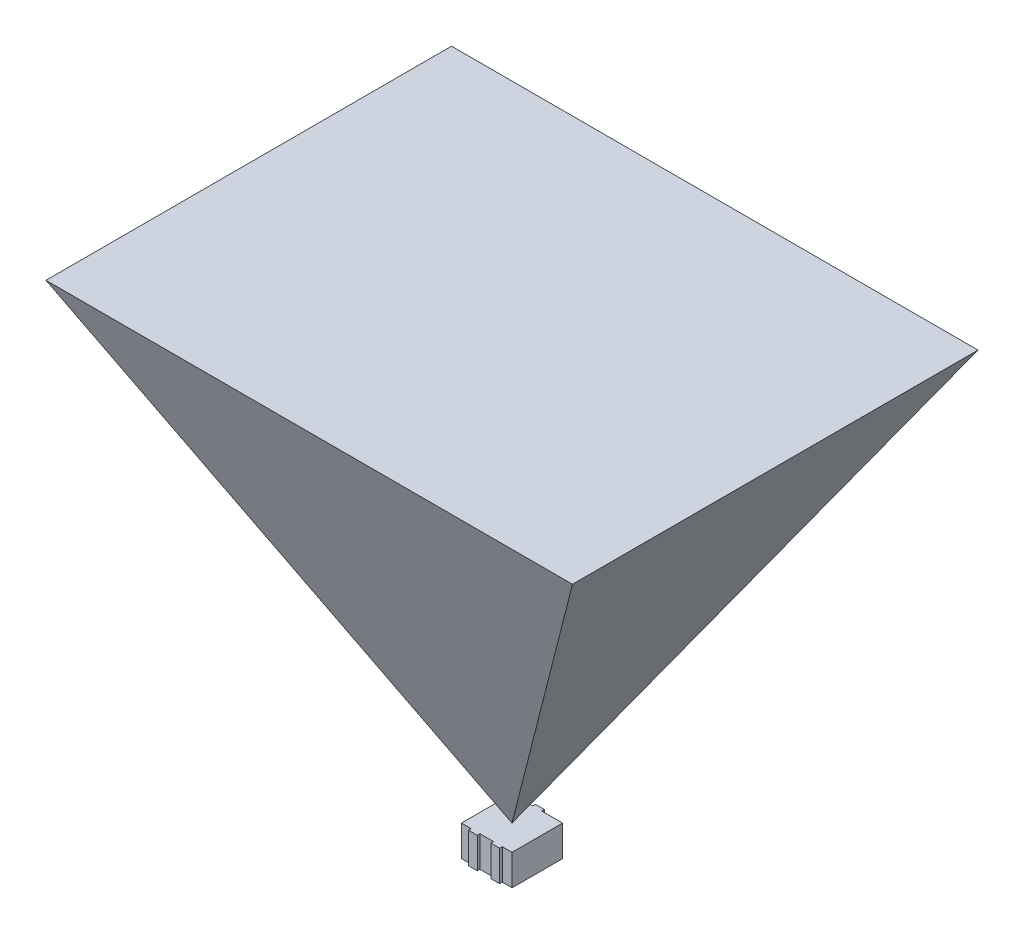
ISO-10303-21;
HEADER;
FILE_DESCRIPTION(('STEP AP214'),'2;1');
FILE_NAME('part.step','',(''),(''),'','','');
FILE_SCHEMA(('AUTOMOTIVE_DESIGN { 1 0 10303 214 1 1 1 1 }'));
ENDSEC;
DATA;
#1=APPLICATION_CONTEXT('core data for automotive mechanical design processes');
#2=APPLICATION_PROTOCOL_DEFINITION('international standard','automotive_design',2000,#1);
#3=PRODUCT_CONTEXT('',#1,'mechanical');
#4=PRODUCT('Part','Part','',(#3));
#5=PRODUCT_RELATED_PRODUCT_CATEGORY('part','',(#4));
#6=PRODUCT_DEFINITION_FORMATION('','',#4);
#7=PRODUCT_DEFINITION_CONTEXT('part definition',#1,'design');
#8=PRODUCT_DEFINITION('design','',#6,#7);
#9=PRODUCT_DEFINITION_SHAPE('','',#8);
#10=(LENGTH_UNIT() NAMED_UNIT(*) SI_UNIT(.MILLI.,.METRE.));
#11=(NAMED_UNIT(*) PLANE_ANGLE_UNIT() SI_UNIT($,.RADIAN.));
#12=(NAMED_UNIT(*) SI_UNIT($,.STERADIAN.) SOLID_ANGLE_UNIT());
#13=UNCERTAINTY_MEASURE_WITH_UNIT(LENGTH_MEASURE(1.E-05),#10,'distance_accuracy_value','');
#14=(GEOMETRIC_REPRESENTATION_CONTEXT(3) GLOBAL_UNCERTAINTY_ASSIGNED_CONTEXT((#13)) GLOBAL_UNIT_ASSIGNED_CONTEXT((#10,
#11,#12)) REPRESENTATION_CONTEXT('',''));
#15=CARTESIAN_POINT('',(0.,0.,0.));
#16=DIRECTION('',(0.,0.,1.));
#17=DIRECTION('',(1.,0.,0.));
#18=AXIS2_PLACEMENT_3D('',#15,#16,#17);
#19=CARTESIAN_POINT('',(-100.,107.,46.1006314427315));
#20=DIRECTION('',(0.,-0.418659737537426,0.908143173825082));
#21=DIRECTION('',(0.,-0.908143173825083,-0.418659737537426));
#22=AXIS2_PLACEMENT_3D('',#19,#20,#21);
#23=PLANE('',#22);
#24=DIRECTION('',(-0.477536528242954,-0.797905396001127,-0.367839425872147));
#25=VECTOR('',#24,1.);
#26=CARTESIAN_POINT('',(23.3966713496263,46.0929891520968,18.0221148489552));
#27=LINE('',#26,#25);
#28=CARTESIAN_POINT('',(59.8487653594311,107.,46.1006314427315));
#29=VERTEX_POINT('',#28);
#30=CARTESIAN_POINT('',(0.,6.99999999999999,0.));
#31=VERTEX_POINT('',#30);
#32=EDGE_CURVE('E72',#29,#31,#27,.T.);
#33=ORIENTED_EDGE('',*,*,#32,.F.);
#34=DIRECTION('',(1.,0.,0.));
#35=VECTOR('',#34,1.);
#36=CARTESIAN_POINT('',(-100.,107.,46.1006314427315));
#37=LINE('',#36,#35);
#38=CARTESIAN_POINT('',(-59.8487653594311,107.,46.1006314427315));
#39=VERTEX_POINT('',#38);
#40=EDGE_CURVE('E86',#39,#29,#37,.T.);
#41=ORIENTED_EDGE('',*,*,#40,.F.);
#42=DIRECTION('',(-0.477536528242954,0.797905396001127,0.367839425872147));
#43=VECTOR('',#42,1.);
#44=CARTESIAN_POINT('',(-69.004898510893,122.298783686636,53.1534673253285));
#45=LINE('',#44,#43);
#46=EDGE_CURVE('E80',#31,#39,#45,.T.);
#47=ORIENTED_EDGE('',*,*,#46,.F.);
#48=EDGE_LOOP('',(#33,#41,#47));
#49=FACE_BOUND('',#48,.T.);
#50=ADVANCED_FACE('F44',(#49),#23,.T.);
#51=CARTESIAN_POINT('',(-100.,107.,-46.1006314427315));
#52=DIRECTION('',(0.,1.,0.));
#53=DIRECTION('',(0.,0.,1.));
#54=AXIS2_PLACEMENT_3D('',#51,#52,#53);
#55=PLANE('',#54);
#56=DIRECTION('',(0.,0.,-1.));
#57=VECTOR('',#56,1.);
#58=CARTESIAN_POINT('',(59.8487653594311,107.,100.));
#59=LINE('',#58,#57);
#60=CARTESIAN_POINT('',(59.8487653594311,107.,-46.1006314427315));
#61=VERTEX_POINT('',#60);
#62=EDGE_CURVE('E74',#29,#61,#59,.T.);
#63=ORIENTED_EDGE('',*,*,#62,.T.);
#64=DIRECTION('',(1.,0.,0.));
#65=VECTOR('',#64,1.);
#66=CARTESIAN_POINT('',(-100.,107.,-46.1006314427315));
#67=LINE('',#66,#65);
#68=CARTESIAN_POINT('',(-59.8487653594311,107.,-46.1006314427315));
#69=VERTEX_POINT('',#68);
#70=EDGE_CURVE('E79',#69,#61,#67,.T.);
#71=ORIENTED_EDGE('',*,*,#70,.F.);
#72=DIRECTION('',(0.,0.,-1.));
#73=VECTOR('',#72,1.);
#74=CARTESIAN_POINT('',(-59.8487653594311,107.,100.));
#75=LINE('',#74,#73);
#76=EDGE_CURVE('E58',#39,#69,#75,.T.);
#77=ORIENTED_EDGE('',*,*,#76,.F.);
#78=ORIENTED_EDGE('',*,*,#40,.T.);
#79=EDGE_LOOP('',(#63,#71,#77,#78));
#80=FACE_BOUND('',#79,.T.);
#81=ADVANCED_FACE('F94',(#80),#55,.T.);
#82=CARTESIAN_POINT('',(-100.,7.,0.));
#83=DIRECTION('',(0.,-0.418659737537426,-0.908143173825082));
#84=DIRECTION('',(0.,0.908143173825083,-0.418659737537426));
#85=AXIS2_PLACEMENT_3D('',#82,#83,#84);
#86=PLANE('',#85);
#87=DIRECTION('',(0.477536528242954,0.797905396001127,-0.367839425872147));
#88=VECTOR('',#87,1.);
#89=CARTESIAN_POINT('',(-22.8041135806333,-31.1028972672698,17.5656762381867));
#90=LINE('',#89,#88);
#91=EDGE_CURVE('E13',#31,#61,#90,.T.);
#92=ORIENTED_EDGE('',*,*,#91,.F.);
#93=DIRECTION('',(0.477536528242954,-0.797905396001127,0.367839425872147));
#94=VECTOR('',#93,1.);
#95=CARTESIAN_POINT('',(-22.8041135806334,45.1028972672698,-17.5656762381866));
#96=LINE('',#95,#94);
#97=EDGE_CURVE('E51',#69,#31,#96,.T.);
#98=ORIENTED_EDGE('',*,*,#97,.F.);
#99=ORIENTED_EDGE('',*,*,#70,.T.);
#100=EDGE_LOOP('',(#92,#98,#99));
#101=FACE_BOUND('',#100,.T.);
#102=ADVANCED_FACE('F87',(#101),#86,.T.);
#103=CARTESIAN_POINT('',(0.,7.,100.));
#104=DIRECTION('',(0.858064905723646,0.513541252058168,0.));
#105=DIRECTION('',(-0.513541252058168,0.858064905723646,0.));
#106=AXIS2_PLACEMENT_3D('',#103,#104,#105);
#107=PLANE('',#106);
#108=ORIENTED_EDGE('',*,*,#46,.T.);
#109=ORIENTED_EDGE('',*,*,#76,.T.);
#110=ORIENTED_EDGE('',*,*,#97,.T.);
#111=EDGE_LOOP('',(#108,#109,#110));
#112=FACE_BOUND('',#111,.T.);
#113=ADVANCED_FACE('F82',(#112),#107,.F.);
#114=CARTESIAN_POINT('',(59.8487653594311,107.,100.));
#115=DIRECTION('',(-0.858064905723646,0.513541252058168,0.));
#116=DIRECTION('',(-0.513541252058168,-0.858064905723646,0.));
#117=AXIS2_PLACEMENT_3D('',#114,#115,#116);
#118=PLANE('',#117);
#119=ORIENTED_EDGE('',*,*,#32,.T.);
#120=ORIENTED_EDGE('',*,*,#91,.T.);
#121=ORIENTED_EDGE('',*,*,#62,.F.);
#122=EDGE_LOOP('',(#119,#120,#121));
#123=FACE_BOUND('',#122,.T.);
#124=ADVANCED_FACE('F73',(#123),#118,.F.);
#125=CLOSED_SHELL('',(#50,#81,#102,#113,#124));
#126=MANIFOLD_SOLID_BREP('B2',#125);
#127=CARTESIAN_POINT('',(1.,7.,-5.75));
#128=DIRECTION('',(0.,0.,1.));
#129=DIRECTION('',(1.,0.,0.));
#130=AXIS2_PLACEMENT_3D('',#127,#128,#129);
#131=PLANE('',#130);
#132=DIRECTION('',(-1.,0.,0.));
#133=VECTOR('',#132,1.);
#134=CARTESIAN_POINT('',(1.,0.,-5.75));
#135=LINE('',#134,#133);
#136=CARTESIAN_POINT('',(5.75,0.,-5.75));
#137=VERTEX_POINT('',#136);
#138=CARTESIAN_POINT('',(1.,0.,-5.75));
#139=VERTEX_POINT('',#138);
#140=EDGE_CURVE('E280',#137,#139,#135,.T.);
#141=ORIENTED_EDGE('',*,*,#140,.T.);
#142=DIRECTION('',(0.,-1.,0.));
#143=VECTOR('',#142,1.);
#144=CARTESIAN_POINT('',(1.,7.,-5.75));
#145=LINE('',#144,#143);
#146=CARTESIAN_POINT('',(1.,7.,-5.75));
#147=VERTEX_POINT('',#146);
#148=EDGE_CURVE('E42',#147,#139,#145,.T.);
#149=ORIENTED_EDGE('',*,*,#148,.F.);
#150=DIRECTION('',(-1.,0.,0.));
#151=VECTOR('',#150,1.);
#152=CARTESIAN_POINT('',(1.,7.,-5.75));
#153=LINE('',#152,#151);
#154=CARTESIAN_POINT('',(5.75,7.,-5.75));
#155=VERTEX_POINT('',#154);
#156=EDGE_CURVE('E311',#155,#147,#153,.T.);
#157=ORIENTED_EDGE('',*,*,#156,.F.);
#158=DIRECTION('',(0.,-1.,0.));
#159=VECTOR('',#158,1.);
#160=CARTESIAN_POINT('',(5.75,7.,-5.75));
#161=LINE('',#160,#159);
#162=EDGE_CURVE('E276',#155,#137,#161,.T.);
#163=ORIENTED_EDGE('',*,*,#162,.T.);
#164=EDGE_LOOP('',(#141,#149,#157,#163));
#165=FACE_BOUND('',#164,.T.);
#166=ADVANCED_FACE('F136',(#165),#131,.F.);
#167=CARTESIAN_POINT('',(1.,7.,-6.35));
#168=DIRECTION('',(-1.,0.,0.));
#169=DIRECTION('',(0.,0.,1.));
#170=AXIS2_PLACEMENT_3D('',#167,#168,#169);
#171=PLANE('',#170);
#172=DIRECTION('',(0.,0.,-1.));
#173=VECTOR('',#172,1.);
#174=CARTESIAN_POINT('',(1.,0.,-6.35));
#175=LINE('',#174,#173);
#176=CARTESIAN_POINT('',(1.,0.,-6.35));
#177=VERTEX_POINT('',#176);
#178=EDGE_CURVE('E283',#139,#177,#175,.T.);
#179=ORIENTED_EDGE('',*,*,#178,.T.);
#180=DIRECTION('',(0.,-1.,0.));
#181=VECTOR('',#180,1.);
#182=CARTESIAN_POINT('',(1.,7.,-6.35));
#183=LINE('',#182,#181);
#184=CARTESIAN_POINT('',(1.,7.,-6.35));
#185=VERTEX_POINT('',#184);
#186=EDGE_CURVE('E144',#185,#177,#183,.T.);
#187=ORIENTED_EDGE('',*,*,#186,.F.);
#188=DIRECTION('',(0.,0.,-1.));
#189=VECTOR('',#188,1.);
#190=CARTESIAN_POINT('',(1.,7.,-6.35));
#191=LINE('',#190,#189);
#192=EDGE_CURVE('E219',#147,#185,#191,.T.);
#193=ORIENTED_EDGE('',*,*,#192,.F.);
#194=ORIENTED_EDGE('',*,*,#148,.T.);
#195=EDGE_LOOP('',(#179,#187,#193,#194));
#196=FACE_BOUND('',#195,.T.);
#197=ADVANCED_FACE('F409',(#196),#171,.F.);
#198=CARTESIAN_POINT('',(-1.,7.,-6.35));
#199=DIRECTION('',(0.,0.,1.));
#200=DIRECTION('',(1.,0.,0.));
#201=AXIS2_PLACEMENT_3D('',#198,#199,#200);
#202=PLANE('',#201);
#203=DIRECTION('',(-1.,0.,0.));
#204=VECTOR('',#203,1.);
#205=CARTESIAN_POINT('',(-1.,0.,-6.35));
#206=LINE('',#205,#204);
#207=CARTESIAN_POINT('',(-1.,0.,-6.35));
#208=VERTEX_POINT('',#207);
#209=EDGE_CURVE('E285',#177,#208,#206,.T.);
#210=ORIENTED_EDGE('',*,*,#209,.T.);
#211=DIRECTION('',(0.,-1.,0.));
#212=VECTOR('',#211,1.);
#213=CARTESIAN_POINT('',(-1.,7.,-6.35));
#214=LINE('',#213,#212);
#215=CARTESIAN_POINT('',(-1.,7.,-6.35));
#216=VERTEX_POINT('',#215);
#217=EDGE_CURVE('E342',#216,#208,#214,.T.);
#218=ORIENTED_EDGE('',*,*,#217,.F.);
#219=DIRECTION('',(-1.,0.,0.));
#220=VECTOR('',#219,1.);
#221=CARTESIAN_POINT('',(-1.,7.,-6.35));
#222=LINE('',#221,#220);
#223=EDGE_CURVE('E350',#185,#216,#222,.T.);
#224=ORIENTED_EDGE('',*,*,#223,.F.);
#225=ORIENTED_EDGE('',*,*,#186,.T.);
#226=EDGE_LOOP('',(#210,#218,#224,#225));
#227=FACE_BOUND('',#226,.T.);
#228=ADVANCED_FACE('F348',(#227),#202,.F.);
#229=CARTESIAN_POINT('',(-1.,7.,-5.75));
#230=DIRECTION('',(1.,0.,0.));
#231=DIRECTION('',(0.,0.,-1.));
#232=AXIS2_PLACEMENT_3D('',#229,#230,#231);
#233=PLANE('',#232);
#234=DIRECTION('',(0.,0.,1.));
#235=VECTOR('',#234,1.);
#236=CARTESIAN_POINT('',(-1.,0.,-5.75));
#237=LINE('',#236,#235);
#238=CARTESIAN_POINT('',(-1.,0.,-5.75));
#239=VERTEX_POINT('',#238);
#240=EDGE_CURVE('E287',#208,#239,#237,.T.);
#241=ORIENTED_EDGE('',*,*,#240,.T.);
#242=DIRECTION('',(0.,-1.,0.));
#243=VECTOR('',#242,1.);
#244=CARTESIAN_POINT('',(-1.,7.,-5.75));
#245=LINE('',#244,#243);
#246=CARTESIAN_POINT('',(-1.,7.,-5.75));
#247=VERTEX_POINT('',#246);
#248=EDGE_CURVE('E339',#247,#239,#245,.T.);
#249=ORIENTED_EDGE('',*,*,#248,.F.);
#250=DIRECTION('',(0.,0.,1.));
#251=VECTOR('',#250,1.);
#252=CARTESIAN_POINT('',(-1.,7.,-5.75));
#253=LINE('',#252,#251);
#254=EDGE_CURVE('E368',#216,#247,#253,.T.);
#255=ORIENTED_EDGE('',*,*,#254,.F.);
#256=ORIENTED_EDGE('',*,*,#217,.T.);
#257=EDGE_LOOP('',(#241,#249,#255,#256));
#258=FACE_BOUND('',#257,.T.);
#259=ADVANCED_FACE('F359',(#258),#233,.F.);
#260=CARTESIAN_POINT('',(-1.,7.,-5.75));
#261=DIRECTION('',(0.,0.,1.));
#262=DIRECTION('',(1.,0.,0.));
#263=AXIS2_PLACEMENT_3D('',#260,#261,#262);
#264=PLANE('',#263);
#265=DIRECTION('',(-1.,0.,0.));
#266=VECTOR('',#265,1.);
#267=CARTESIAN_POINT('',(-1.,0.,-5.75));
#268=LINE('',#267,#266);
#269=CARTESIAN_POINT('',(-5.75,0.,-5.75));
#270=VERTEX_POINT('',#269);
#271=EDGE_CURVE('E289',#239,#270,#268,.T.);
#272=ORIENTED_EDGE('',*,*,#271,.T.);
#273=DIRECTION('',(0.,-1.,0.));
#274=VECTOR('',#273,1.);
#275=CARTESIAN_POINT('',(-5.75,7.,-5.75));
#276=LINE('',#275,#274);
#277=CARTESIAN_POINT('',(-5.75,7.,-5.75));
#278=VERTEX_POINT('',#277);
#279=EDGE_CURVE('E336',#278,#270,#276,.T.);
#280=ORIENTED_EDGE('',*,*,#279,.F.);
#281=DIRECTION('',(-1.,0.,0.));
#282=VECTOR('',#281,1.);
#283=CARTESIAN_POINT('',(-1.,7.,-5.75));
#284=LINE('',#283,#282);
#285=EDGE_CURVE('E365',#247,#278,#284,.T.);
#286=ORIENTED_EDGE('',*,*,#285,.F.);
#287=ORIENTED_EDGE('',*,*,#248,.T.);
#288=EDGE_LOOP('',(#272,#280,#286,#287));
#289=FACE_BOUND('',#288,.T.);
#290=ADVANCED_FACE('F363',(#289),#264,.F.);
#291=CARTESIAN_POINT('',(-5.75,7.,5.75));
#292=DIRECTION('',(1.,0.,0.));
#293=DIRECTION('',(0.,0.,-1.));
#294=AXIS2_PLACEMENT_3D('',#291,#292,#293);
#295=PLANE('',#294);
#296=DIRECTION('',(0.,0.,1.));
#297=VECTOR('',#296,1.);
#298=CARTESIAN_POINT('',(-5.75,0.,5.75));
#299=LINE('',#298,#297);
#300=CARTESIAN_POINT('',(-5.75,0.,5.75));
#301=VERTEX_POINT('',#300);
#302=EDGE_CURVE('E291',#270,#301,#299,.T.);
#303=ORIENTED_EDGE('',*,*,#302,.T.);
#304=DIRECTION('',(0.,-1.,0.));
#305=VECTOR('',#304,1.);
#306=CARTESIAN_POINT('',(-5.75,7.,5.75));
#307=LINE('',#306,#305);
#308=CARTESIAN_POINT('',(-5.75,7.,5.75));
#309=VERTEX_POINT('',#308);
#310=EDGE_CURVE('E333',#309,#301,#307,.T.);
#311=ORIENTED_EDGE('',*,*,#310,.F.);
#312=DIRECTION('',(0.,0.,1.));
#313=VECTOR('',#312,1.);
#314=CARTESIAN_POINT('',(-5.75,7.,5.75));
#315=LINE('',#314,#313);
#316=EDGE_CURVE('E367',#278,#309,#315,.T.);
#317=ORIENTED_EDGE('',*,*,#316,.F.);
#318=ORIENTED_EDGE('',*,*,#279,.T.);
#319=EDGE_LOOP('',(#303,#311,#317,#318));
#320=FACE_BOUND('',#319,.T.);
#321=ADVANCED_FACE('F422',(#320),#295,.F.);
#322=CARTESIAN_POINT('',(-5.75,7.,5.75));
#323=DIRECTION('',(0.,0.,-1.));
#324=DIRECTION('',(-1.,0.,0.));
#325=AXIS2_PLACEMENT_3D('',#322,#323,#324);
#326=PLANE('',#325);
#327=DIRECTION('',(1.,0.,0.));
#328=VECTOR('',#327,1.);
#329=CARTESIAN_POINT('',(-5.75,0.,5.75));
#330=LINE('',#329,#328);
#331=CARTESIAN_POINT('',(-3.55,0.,5.75));
#332=VERTEX_POINT('',#331);
#333=EDGE_CURVE('E293',#301,#332,#330,.T.);
#334=ORIENTED_EDGE('',*,*,#333,.T.);
#335=DIRECTION('',(0.,-1.,0.));
#336=VECTOR('',#335,1.);
#337=CARTESIAN_POINT('',(-3.55,7.,5.75));
#338=LINE('',#337,#336);
#339=CARTESIAN_POINT('',(-3.55,7.,5.75));
#340=VERTEX_POINT('',#339);
#341=EDGE_CURVE('E330',#340,#332,#338,.T.);
#342=ORIENTED_EDGE('',*,*,#341,.F.);
#343=DIRECTION('',(1.,0.,0.));
#344=VECTOR('',#343,1.);
#345=CARTESIAN_POINT('',(-5.75,7.,5.75));
#346=LINE('',#345,#344);
#347=EDGE_CURVE('E370',#309,#340,#346,.T.);
#348=ORIENTED_EDGE('',*,*,#347,.F.);
#349=ORIENTED_EDGE('',*,*,#310,.T.);
#350=EDGE_LOOP('',(#334,#342,#348,#349));
#351=FACE_BOUND('',#350,.T.);
#352=ADVANCED_FACE('F425',(#351),#326,.F.);
#353=CARTESIAN_POINT('',(-3.55,7.,5.75));
#354=DIRECTION('',(1.,0.,0.));
#355=DIRECTION('',(0.,0.,-1.));
#356=AXIS2_PLACEMENT_3D('',#353,#354,#355);
#357=PLANE('',#356);
#358=DIRECTION('',(0.,0.,1.));
#359=VECTOR('',#358,1.);
#360=CARTESIAN_POINT('',(-3.55,0.,5.75));
#361=LINE('',#360,#359);
#362=CARTESIAN_POINT('',(-3.55,0.,6.35));
#363=VERTEX_POINT('',#362);
#364=EDGE_CURVE('E295',#332,#363,#361,.T.);
#365=ORIENTED_EDGE('',*,*,#364,.T.);
#366=DIRECTION('',(0.,-1.,0.));
#367=VECTOR('',#366,1.);
#368=CARTESIAN_POINT('',(-3.55,7.,6.35));
#369=LINE('',#368,#367);
#370=CARTESIAN_POINT('',(-3.55,7.,6.35));
#371=VERTEX_POINT('',#370);
#372=EDGE_CURVE('E327',#371,#363,#369,.T.);
#373=ORIENTED_EDGE('',*,*,#372,.F.);
#374=DIRECTION('',(0.,0.,1.));
#375=VECTOR('',#374,1.);
#376=CARTESIAN_POINT('',(-3.55,7.,5.75));
#377=LINE('',#376,#375);
#378=EDGE_CURVE('E376',#340,#371,#377,.T.);
#379=ORIENTED_EDGE('',*,*,#378,.F.);
#380=ORIENTED_EDGE('',*,*,#341,.T.);
#381=EDGE_LOOP('',(#365,#373,#379,#380));
#382=FACE_BOUND('',#381,.T.);
#383=ADVANCED_FACE('F429',(#382),#357,.F.);
#384=CARTESIAN_POINT('',(-3.55,7.,6.35));
#385=DIRECTION('',(0.,0.,-1.));
#386=DIRECTION('',(-1.,0.,0.));
#387=AXIS2_PLACEMENT_3D('',#384,#385,#386);
#388=PLANE('',#387);
#389=DIRECTION('',(1.,0.,0.));
#390=VECTOR('',#389,1.);
#391=CARTESIAN_POINT('',(-3.55,0.,6.35));
#392=LINE('',#391,#390);
#393=CARTESIAN_POINT('',(-1.55,0.,6.35));
#394=VERTEX_POINT('',#393);
#395=EDGE_CURVE('E297',#363,#394,#392,.T.);
#396=ORIENTED_EDGE('',*,*,#395,.T.);
#397=DIRECTION('',(0.,-1.,0.));
#398=VECTOR('',#397,1.);
#399=CARTESIAN_POINT('',(-1.55,7.,6.35));
#400=LINE('',#399,#398);
#401=CARTESIAN_POINT('',(-1.55,7.,6.35));
#402=VERTEX_POINT('',#401);
#403=EDGE_CURVE('E324',#402,#394,#400,.T.);
#404=ORIENTED_EDGE('',*,*,#403,.F.);
#405=DIRECTION('',(1.,0.,0.));
#406=VECTOR('',#405,1.);
#407=CARTESIAN_POINT('',(-3.55,7.,6.35));
#408=LINE('',#407,#406);
#409=EDGE_CURVE('E378',#371,#402,#408,.T.);
#410=ORIENTED_EDGE('',*,*,#409,.F.);
#411=ORIENTED_EDGE('',*,*,#372,.T.);
#412=EDGE_LOOP('',(#396,#404,#410,#411));
#413=FACE_BOUND('',#412,.T.);
#414=ADVANCED_FACE('F433',(#413),#388,.F.);
#415=CARTESIAN_POINT('',(-1.55,7.,6.35));
#416=DIRECTION('',(-1.,0.,0.));
#417=DIRECTION('',(0.,0.,1.));
#418=AXIS2_PLACEMENT_3D('',#415,#416,#417);
#419=PLANE('',#418);
#420=DIRECTION('',(0.,0.,-1.));
#421=VECTOR('',#420,1.);
#422=CARTESIAN_POINT('',(-1.55,0.,6.35));
#423=LINE('',#422,#421);
#424=CARTESIAN_POINT('',(-1.55,0.,5.75));
#425=VERTEX_POINT('',#424);
#426=EDGE_CURVE('E299',#394,#425,#423,.T.);
#427=ORIENTED_EDGE('',*,*,#426,.T.);
#428=DIRECTION('',(0.,-1.,0.));
#429=VECTOR('',#428,1.);
#430=CARTESIAN_POINT('',(-1.55,7.,5.75));
#431=LINE('',#430,#429);
#432=CARTESIAN_POINT('',(-1.55,7.,5.75));
#433=VERTEX_POINT('',#432);
#434=EDGE_CURVE('E321',#433,#425,#431,.T.);
#435=ORIENTED_EDGE('',*,*,#434,.F.);
#436=DIRECTION('',(0.,0.,-1.));
#437=VECTOR('',#436,1.);
#438=CARTESIAN_POINT('',(-1.55,7.,6.35));
#439=LINE('',#438,#437);
#440=EDGE_CURVE('E380',#402,#433,#439,.T.);
#441=ORIENTED_EDGE('',*,*,#440,.F.);
#442=ORIENTED_EDGE('',*,*,#403,.T.);
#443=EDGE_LOOP('',(#427,#435,#441,#442));
#444=FACE_BOUND('',#443,.T.);
#445=ADVANCED_FACE('F437',(#444),#419,.F.);
#446=CARTESIAN_POINT('',(0.,7.,5.75));
#447=DIRECTION('',(0.,0.,-1.));
#448=DIRECTION('',(-1.,0.,0.));
#449=AXIS2_PLACEMENT_3D('',#446,#447,#448);
#450=PLANE('',#449);
#451=DIRECTION('',(1.,0.,0.));
#452=VECTOR('',#451,1.);
#453=CARTESIAN_POINT('',(0.,0.,5.75));
#454=LINE('',#453,#452);
#455=CARTESIAN_POINT('',(1.55,0.,5.75));
#456=VERTEX_POINT('',#455);
#457=EDGE_CURVE('E302',#425,#456,#454,.T.);
#458=ORIENTED_EDGE('',*,*,#457,.T.);
#459=DIRECTION('',(0.,-1.,0.));
#460=VECTOR('',#459,1.);
#461=CARTESIAN_POINT('',(1.55,7.,5.75));
#462=LINE('',#461,#460);
#463=CARTESIAN_POINT('',(1.55,7.,5.75));
#464=VERTEX_POINT('',#463);
#465=EDGE_CURVE('E318',#464,#456,#462,.T.);
#466=ORIENTED_EDGE('',*,*,#465,.F.);
#467=DIRECTION('',(1.,0.,0.));
#468=VECTOR('',#467,1.);
#469=CARTESIAN_POINT('',(-1.55,7.,5.75));
#470=LINE('',#469,#468);
#471=EDGE_CURVE('E382',#433,#464,#470,.T.);
#472=ORIENTED_EDGE('',*,*,#471,.F.);
#473=ORIENTED_EDGE('',*,*,#434,.T.);
#474=EDGE_LOOP('',(#458,#466,#472,#473));
#475=FACE_BOUND('',#474,.T.);
#476=ADVANCED_FACE('F441',(#475),#450,.F.);
#477=CARTESIAN_POINT('',(1.55,7.,5.75));
#478=DIRECTION('',(1.,0.,0.));
#479=DIRECTION('',(0.,0.,-1.));
#480=AXIS2_PLACEMENT_3D('',#477,#478,#479);
#481=PLANE('',#480);
#482=DIRECTION('',(0.,0.,1.));
#483=VECTOR('',#482,1.);
#484=CARTESIAN_POINT('',(1.55,0.,5.75));
#485=LINE('',#484,#483);
#486=CARTESIAN_POINT('',(1.55,0.,6.35));
#487=VERTEX_POINT('',#486);
#488=EDGE_CURVE('E304',#456,#487,#485,.T.);
#489=ORIENTED_EDGE('',*,*,#488,.T.);
#490=DIRECTION('',(0.,-1.,0.));
#491=VECTOR('',#490,1.);
#492=CARTESIAN_POINT('',(1.55,7.,6.35));
#493=LINE('',#492,#491);
#494=CARTESIAN_POINT('',(1.55,7.,6.35));
#495=VERTEX_POINT('',#494);
#496=EDGE_CURVE('E315',#495,#487,#493,.T.);
#497=ORIENTED_EDGE('',*,*,#496,.F.);
#498=DIRECTION('',(0.,0.,1.));
#499=VECTOR('',#498,1.);
#500=CARTESIAN_POINT('',(1.55,7.,5.75));
#501=LINE('',#500,#499);
#502=EDGE_CURVE('E384',#464,#495,#501,.T.);
#503=ORIENTED_EDGE('',*,*,#502,.F.);
#504=ORIENTED_EDGE('',*,*,#465,.T.);
#505=EDGE_LOOP('',(#489,#497,#503,#504));
#506=FACE_BOUND('',#505,.T.);
#507=ADVANCED_FACE('F390',(#506),#481,.F.);
#508=CARTESIAN_POINT('',(1.55,7.,6.35));
#509=DIRECTION('',(0.,0.,-1.));
#510=DIRECTION('',(-1.,0.,0.));
#511=AXIS2_PLACEMENT_3D('',#508,#509,#510);
#512=PLANE('',#511);
#513=DIRECTION('',(1.,0.,0.));
#514=VECTOR('',#513,1.);
#515=CARTESIAN_POINT('',(1.55,0.,6.35));
#516=LINE('',#515,#514);
#517=CARTESIAN_POINT('',(3.55,0.,6.35));
#518=VERTEX_POINT('',#517);
#519=EDGE_CURVE('E306',#487,#518,#516,.T.);
#520=ORIENTED_EDGE('',*,*,#519,.T.);
#521=DIRECTION('',(0.,-1.,0.));
#522=VECTOR('',#521,1.);
#523=CARTESIAN_POINT('',(3.55,7.,6.35));
#524=LINE('',#523,#522);
#525=CARTESIAN_POINT('',(3.55,7.,6.35));
#526=VERTEX_POINT('',#525);
#527=EDGE_CURVE('E271',#526,#518,#524,.T.);
#528=ORIENTED_EDGE('',*,*,#527,.F.);
#529=DIRECTION('',(1.,0.,0.));
#530=VECTOR('',#529,1.);
#531=CARTESIAN_POINT('',(1.55,7.,6.35));
#532=LINE('',#531,#530);
#533=EDGE_CURVE('E262',#495,#526,#532,.T.);
#534=ORIENTED_EDGE('',*,*,#533,.F.);
#535=ORIENTED_EDGE('',*,*,#496,.T.);
#536=EDGE_LOOP('',(#520,#528,#534,#535));
#537=FACE_BOUND('',#536,.T.);
#538=ADVANCED_FACE('F394',(#537),#512,.F.);
#539=CARTESIAN_POINT('',(3.55,7.,6.35));
#540=DIRECTION('',(-1.,0.,0.));
#541=DIRECTION('',(0.,0.,1.));
#542=AXIS2_PLACEMENT_3D('',#539,#540,#541);
#543=PLANE('',#542);
#544=DIRECTION('',(0.,0.,-1.));
#545=VECTOR('',#544,1.);
#546=CARTESIAN_POINT('',(3.55,0.,6.35));
#547=LINE('',#546,#545);
#548=CARTESIAN_POINT('',(3.55,0.,5.75));
#549=VERTEX_POINT('',#548);
#550=EDGE_CURVE('E270',#518,#549,#547,.T.);
#551=ORIENTED_EDGE('',*,*,#550,.T.);
#552=DIRECTION('',(0.,-1.,0.));
#553=VECTOR('',#552,1.);
#554=CARTESIAN_POINT('',(3.55,7.,5.75));
#555=LINE('',#554,#553);
#556=CARTESIAN_POINT('',(3.55,7.,5.75));
#557=VERTEX_POINT('',#556);
#558=EDGE_CURVE('E267',#557,#549,#555,.T.);
#559=ORIENTED_EDGE('',*,*,#558,.F.);
#560=DIRECTION('',(0.,0.,-1.));
#561=VECTOR('',#560,1.);
#562=CARTESIAN_POINT('',(3.55,7.,6.35));
#563=LINE('',#562,#561);
#564=EDGE_CURVE('E256',#526,#557,#563,.T.);
#565=ORIENTED_EDGE('',*,*,#564,.F.);
#566=ORIENTED_EDGE('',*,*,#527,.T.);
#567=EDGE_LOOP('',(#551,#559,#565,#566));
#568=FACE_BOUND('',#567,.T.);
#569=ADVANCED_FACE('F268',(#568),#543,.F.);
#570=CARTESIAN_POINT('',(3.55,7.,5.75));
#571=DIRECTION('',(0.,0.,-1.));
#572=DIRECTION('',(-1.,0.,0.));
#573=AXIS2_PLACEMENT_3D('',#570,#571,#572);
#574=PLANE('',#573);
#575=DIRECTION('',(1.,0.,0.));
#576=VECTOR('',#575,1.);
#577=CARTESIAN_POINT('',(3.55,0.,5.75));
#578=LINE('',#577,#576);
#579=CARTESIAN_POINT('',(5.75,0.,5.75));
#580=VERTEX_POINT('',#579);
#581=EDGE_CURVE('E205',#549,#580,#578,.T.);
#582=ORIENTED_EDGE('',*,*,#581,.T.);
#583=DIRECTION('',(0.,-1.,0.));
#584=VECTOR('',#583,1.);
#585=CARTESIAN_POINT('',(5.75,7.,5.75));
#586=LINE('',#585,#584);
#587=CARTESIAN_POINT('',(5.75,7.,5.75));
#588=VERTEX_POINT('',#587);
#589=EDGE_CURVE('E272',#588,#580,#586,.T.);
#590=ORIENTED_EDGE('',*,*,#589,.F.);
#591=DIRECTION('',(1.,0.,0.));
#592=VECTOR('',#591,1.);
#593=CARTESIAN_POINT('',(3.55,7.,5.75));
#594=LINE('',#593,#592);
#595=EDGE_CURVE('E260',#557,#588,#594,.T.);
#596=ORIENTED_EDGE('',*,*,#595,.F.);
#597=ORIENTED_EDGE('',*,*,#558,.T.);
#598=EDGE_LOOP('',(#582,#590,#596,#597));
#599=FACE_BOUND('',#598,.T.);
#600=ADVANCED_FACE('F274',(#599),#574,.F.);
#601=CARTESIAN_POINT('',(5.75,7.,5.75));
#602=DIRECTION('',(-1.,0.,0.));
#603=DIRECTION('',(0.,0.,1.));
#604=AXIS2_PLACEMENT_3D('',#601,#602,#603);
#605=PLANE('',#604);
#606=DIRECTION('',(0.,0.,-1.));
#607=VECTOR('',#606,1.);
#608=CARTESIAN_POINT('',(5.75,0.,5.75));
#609=LINE('',#608,#607);
#610=EDGE_CURVE('E211',#580,#137,#609,.T.);
#611=ORIENTED_EDGE('',*,*,#610,.T.);
#612=ORIENTED_EDGE('',*,*,#162,.F.);
#613=DIRECTION('',(0.,0.,-1.));
#614=VECTOR('',#613,1.);
#615=CARTESIAN_POINT('',(5.75,7.,5.75));
#616=LINE('',#615,#614);
#617=EDGE_CURVE('E152',#588,#155,#616,.T.);
#618=ORIENTED_EDGE('',*,*,#617,.F.);
#619=ORIENTED_EDGE('',*,*,#589,.T.);
#620=EDGE_LOOP('',(#611,#612,#618,#619));
#621=FACE_BOUND('',#620,.T.);
#622=ADVANCED_FACE('F398',(#621),#605,.F.);
#623=CARTESIAN_POINT('',(0.,7.,0.));
#624=DIRECTION('',(0.,1.,0.));
#625=DIRECTION('',(0.,0.,1.));
#626=AXIS2_PLACEMENT_3D('',#623,#624,#625);
#627=PLANE('',#626);
#628=ORIENTED_EDGE('',*,*,#156,.T.);
#629=ORIENTED_EDGE('',*,*,#192,.T.);
#630=ORIENTED_EDGE('',*,*,#223,.T.);
#631=ORIENTED_EDGE('',*,*,#254,.T.);
#632=ORIENTED_EDGE('',*,*,#285,.T.);
#633=ORIENTED_EDGE('',*,*,#316,.T.);
#634=ORIENTED_EDGE('',*,*,#347,.T.);
#635=ORIENTED_EDGE('',*,*,#378,.T.);
#636=ORIENTED_EDGE('',*,*,#409,.T.);
#637=ORIENTED_EDGE('',*,*,#440,.T.);
#638=ORIENTED_EDGE('',*,*,#471,.T.);
#639=ORIENTED_EDGE('',*,*,#502,.T.);
#640=ORIENTED_EDGE('',*,*,#533,.T.);
#641=ORIENTED_EDGE('',*,*,#564,.T.);
#642=ORIENTED_EDGE('',*,*,#595,.T.);
#643=ORIENTED_EDGE('',*,*,#617,.T.);
#644=EDGE_LOOP('',(#628,#629,#630,#631,#632,#633,#634,#635,#636,#637,#638,#639,#640,#641,#642,#643));
#645=FACE_BOUND('',#644,.T.);
#646=ADVANCED_FACE('F258',(#645),#627,.T.);
#647=CARTESIAN_POINT('',(0.,0.,0.));
#648=DIRECTION('',(0.,1.,0.));
#649=DIRECTION('',(0.,0.,1.));
#650=AXIS2_PLACEMENT_3D('',#647,#648,#649);
#651=PLANE('',#650);
#652=ORIENTED_EDGE('',*,*,#140,.F.);
#653=ORIENTED_EDGE('',*,*,#610,.F.);
#654=ORIENTED_EDGE('',*,*,#581,.F.);
#655=ORIENTED_EDGE('',*,*,#550,.F.);
#656=ORIENTED_EDGE('',*,*,#519,.F.);
#657=ORIENTED_EDGE('',*,*,#488,.F.);
#658=ORIENTED_EDGE('',*,*,#457,.F.);
#659=ORIENTED_EDGE('',*,*,#426,.F.);
#660=ORIENTED_EDGE('',*,*,#395,.F.);
#661=ORIENTED_EDGE('',*,*,#364,.F.);
#662=ORIENTED_EDGE('',*,*,#333,.F.);
#663=ORIENTED_EDGE('',*,*,#302,.F.);
#664=ORIENTED_EDGE('',*,*,#271,.F.);
#665=ORIENTED_EDGE('',*,*,#240,.F.);
#666=ORIENTED_EDGE('',*,*,#209,.F.);
#667=ORIENTED_EDGE('',*,*,#178,.F.);
#668=EDGE_LOOP('',(#652,#653,#654,#655,#656,#657,#658,#659,#660,#661,#662,#663,#664,#665,#666,#667));
#669=FACE_BOUND('',#668,.T.);
#670=ADVANCED_FACE('F354',(#669),#651,.F.);
#671=CLOSED_SHELL('',(#166,#197,#228,#259,#290,#321,#352,#383,#414,#445,#476,#507,#538,#569,
#600,#622,#646,#670));
#672=MANIFOLD_SOLID_BREP('B7',#671);
#673=ADVANCED_BREP_SHAPE_REPRESENTATION('',(#18,#126,#672),#14);
#674=SHAPE_DEFINITION_REPRESENTATION(#9,#673);
ENDSEC;
END-ISO-10303-21;
